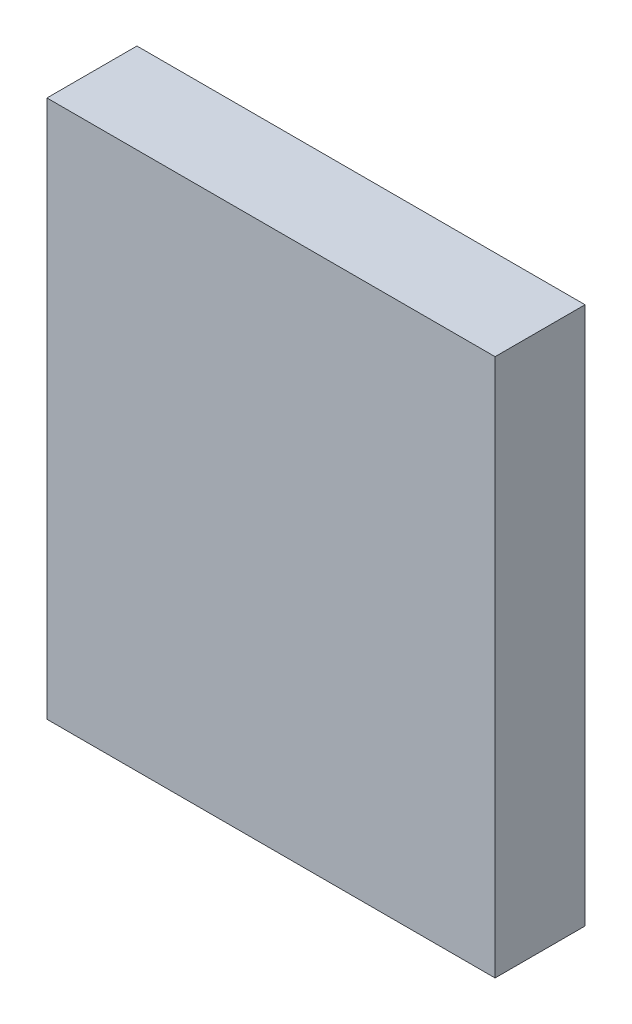
ISO-10303-21;
HEADER;
FILE_DESCRIPTION(('STEP AP214'),'2;1');
FILE_NAME('part.step','',(''),(''),'','','');
FILE_SCHEMA(('AUTOMOTIVE_DESIGN { 1 0 10303 214 1 1 1 1 }'));
ENDSEC;
DATA;
#1=APPLICATION_CONTEXT('core data for automotive mechanical design processes');
#2=APPLICATION_PROTOCOL_DEFINITION('international standard','automotive_design',2000,#1);
#3=PRODUCT_CONTEXT('',#1,'mechanical');
#4=PRODUCT('Part','Part','',(#3));
#5=PRODUCT_RELATED_PRODUCT_CATEGORY('part','',(#4));
#6=PRODUCT_DEFINITION_FORMATION('','',#4);
#7=PRODUCT_DEFINITION_CONTEXT('part definition',#1,'design');
#8=PRODUCT_DEFINITION('design','',#6,#7);
#9=PRODUCT_DEFINITION_SHAPE('','',#8);
#10=(LENGTH_UNIT() NAMED_UNIT(*) SI_UNIT(.MILLI.,.METRE.));
#11=(NAMED_UNIT(*) PLANE_ANGLE_UNIT() SI_UNIT($,.RADIAN.));
#12=(NAMED_UNIT(*) SI_UNIT($,.STERADIAN.) SOLID_ANGLE_UNIT());
#13=UNCERTAINTY_MEASURE_WITH_UNIT(LENGTH_MEASURE(1.E-05),#10,'distance_accuracy_value','');
#14=(GEOMETRIC_REPRESENTATION_CONTEXT(3) GLOBAL_UNCERTAINTY_ASSIGNED_CONTEXT((#13)) GLOBAL_UNIT_ASSIGNED_CONTEXT((#10,
#11,#12)) REPRESENTATION_CONTEXT('',''));
#15=CARTESIAN_POINT('',(0.,0.,0.));
#16=DIRECTION('',(0.,0.,1.));
#17=DIRECTION('',(1.,0.,0.));
#18=AXIS2_PLACEMENT_3D('',#15,#16,#17);
#19=CARTESIAN_POINT('',(-0.127,0.698,0.));
#20=DIRECTION('',(0.,-1.,0.));
#21=DIRECTION('',(0.,0.,1.));
#22=AXIS2_PLACEMENT_3D('',#19,#20,#21);
#23=PLANE('',#22);
#24=DIRECTION('',(-1.,0.,0.));
#25=VECTOR('',#24,1.);
#26=CARTESIAN_POINT('',(0.127,0.698,0.));
#27=LINE('',#26,#25);
#28=CARTESIAN_POINT('',(0.127,0.698,0.));
#29=VERTEX_POINT('',#28);
#30=CARTESIAN_POINT('',(-0.127,0.698,0.));
#31=VERTEX_POINT('',#30);
#32=EDGE_CURVE('E11',#29,#31,#27,.T.);
#33=ORIENTED_EDGE('',*,*,#32,.F.);
#34=DIRECTION('',(0.,0.,-1.));
#35=VECTOR('',#34,1.);
#36=CARTESIAN_POINT('',(0.127,0.698,0.051));
#37=LINE('',#36,#35);
#38=CARTESIAN_POINT('',(0.127,0.698,0.051));
#39=VERTEX_POINT('',#38);
#40=EDGE_CURVE('E24',#39,#29,#37,.T.);
#41=ORIENTED_EDGE('',*,*,#40,.F.);
#42=DIRECTION('',(1.,0.,0.));
#43=VECTOR('',#42,1.);
#44=CARTESIAN_POINT('',(-0.127,0.698,0.051));
#45=LINE('',#44,#43);
#46=CARTESIAN_POINT('',(-0.127,0.698,0.051));
#47=VERTEX_POINT('',#46);
#48=EDGE_CURVE('E88',#47,#39,#45,.T.);
#49=ORIENTED_EDGE('',*,*,#48,.F.);
#50=DIRECTION('',(0.,0.,1.));
#51=VECTOR('',#50,1.);
#52=CARTESIAN_POINT('',(-0.127,0.698,0.));
#53=LINE('',#52,#51);
#54=EDGE_CURVE('E77',#31,#47,#53,.T.);
#55=ORIENTED_EDGE('',*,*,#54,.F.);
#56=EDGE_LOOP('',(#33,#41,#49,#55));
#57=FACE_BOUND('',#56,.T.);
#58=ADVANCED_FACE('F17',(#57),#23,.T.);
#59=CARTESIAN_POINT('',(0.127,0.698,0.));
#60=DIRECTION('',(1.,0.,0.));
#61=DIRECTION('',(0.,0.,1.));
#62=AXIS2_PLACEMENT_3D('',#59,#60,#61);
#63=PLANE('',#62);
#64=DIRECTION('',(0.,-1.,0.));
#65=VECTOR('',#64,1.);
#66=CARTESIAN_POINT('',(0.127,1.003,0.));
#67=LINE('',#66,#65);
#68=CARTESIAN_POINT('',(0.127,1.003,0.));
#69=VERTEX_POINT('',#68);
#70=EDGE_CURVE('E85',#69,#29,#67,.T.);
#71=ORIENTED_EDGE('',*,*,#70,.F.);
#72=DIRECTION('',(0.,0.,-1.));
#73=VECTOR('',#72,1.);
#74=CARTESIAN_POINT('',(0.127,1.003,0.051));
#75=LINE('',#74,#73);
#76=CARTESIAN_POINT('',(0.127,1.003,0.051));
#77=VERTEX_POINT('',#76);
#78=EDGE_CURVE('E83',#77,#69,#75,.T.);
#79=ORIENTED_EDGE('',*,*,#78,.F.);
#80=DIRECTION('',(0.,1.,0.));
#81=VECTOR('',#80,1.);
#82=CARTESIAN_POINT('',(0.127,0.698,0.051));
#83=LINE('',#82,#81);
#84=EDGE_CURVE('E72',#39,#77,#83,.T.);
#85=ORIENTED_EDGE('',*,*,#84,.F.);
#86=ORIENTED_EDGE('',*,*,#40,.T.);
#87=EDGE_LOOP('',(#71,#79,#85,#86));
#88=FACE_BOUND('',#87,.T.);
#89=ADVANCED_FACE('F90',(#88),#63,.T.);
#90=CARTESIAN_POINT('',(0.127,1.003,0.));
#91=DIRECTION('',(0.,1.,0.));
#92=DIRECTION('',(0.,0.,1.));
#93=AXIS2_PLACEMENT_3D('',#90,#91,#92);
#94=PLANE('',#93);
#95=DIRECTION('',(1.,0.,0.));
#96=VECTOR('',#95,1.);
#97=CARTESIAN_POINT('',(-0.127,1.003,0.));
#98=LINE('',#97,#96);
#99=CARTESIAN_POINT('',(-0.127,1.003,0.));
#100=VERTEX_POINT('',#99);
#101=EDGE_CURVE('E60',#100,#69,#98,.T.);
#102=ORIENTED_EDGE('',*,*,#101,.F.);
#103=DIRECTION('',(0.,0.,-1.));
#104=VECTOR('',#103,1.);
#105=CARTESIAN_POINT('',(-0.127,1.003,0.051));
#106=LINE('',#105,#104);
#107=CARTESIAN_POINT('',(-0.127,1.003,0.051));
#108=VERTEX_POINT('',#107);
#109=EDGE_CURVE('E54',#108,#100,#106,.T.);
#110=ORIENTED_EDGE('',*,*,#109,.F.);
#111=DIRECTION('',(-1.,0.,0.));
#112=VECTOR('',#111,1.);
#113=CARTESIAN_POINT('',(0.127,1.003,0.051));
#114=LINE('',#113,#112);
#115=EDGE_CURVE('E58',#77,#108,#114,.T.);
#116=ORIENTED_EDGE('',*,*,#115,.F.);
#117=ORIENTED_EDGE('',*,*,#78,.T.);
#118=EDGE_LOOP('',(#102,#110,#116,#117));
#119=FACE_BOUND('',#118,.T.);
#120=ADVANCED_FACE('F56',(#119),#94,.T.);
#121=CARTESIAN_POINT('',(-0.127,1.003,0.));
#122=DIRECTION('',(-1.,0.,0.));
#123=DIRECTION('',(0.,0.,1.));
#124=AXIS2_PLACEMENT_3D('',#121,#122,#123);
#125=PLANE('',#124);
#126=DIRECTION('',(0.,1.,0.));
#127=VECTOR('',#126,1.);
#128=CARTESIAN_POINT('',(-0.127,0.698,0.));
#129=LINE('',#128,#127);
#130=EDGE_CURVE('E73',#31,#100,#129,.T.);
#131=ORIENTED_EDGE('',*,*,#130,.F.);
#132=ORIENTED_EDGE('',*,*,#54,.T.);
#133=DIRECTION('',(0.,-1.,0.));
#134=VECTOR('',#133,1.);
#135=CARTESIAN_POINT('',(-0.127,1.003,0.051));
#136=LINE('',#135,#134);
#137=EDGE_CURVE('E70',#108,#47,#136,.T.);
#138=ORIENTED_EDGE('',*,*,#137,.F.);
#139=ORIENTED_EDGE('',*,*,#109,.T.);
#140=EDGE_LOOP('',(#131,#132,#138,#139));
#141=FACE_BOUND('',#140,.T.);
#142=ADVANCED_FACE('F76',(#141),#125,.T.);
#143=CARTESIAN_POINT('',(-0.127,1.003,0.));
#144=DIRECTION('',(0.,0.,-1.));
#145=DIRECTION('',(0.,1.,0.));
#146=AXIS2_PLACEMENT_3D('',#143,#144,#145);
#147=PLANE('',#146);
#148=ORIENTED_EDGE('',*,*,#101,.T.);
#149=ORIENTED_EDGE('',*,*,#70,.T.);
#150=ORIENTED_EDGE('',*,*,#32,.T.);
#151=ORIENTED_EDGE('',*,*,#130,.T.);
#152=EDGE_LOOP('',(#148,#149,#150,#151));
#153=FACE_BOUND('',#152,.T.);
#154=ADVANCED_FACE('F91',(#153),#147,.T.);
#155=CARTESIAN_POINT('',(-0.127,0.698,0.051));
#156=DIRECTION('',(0.,0.,1.));
#157=DIRECTION('',(0.,1.,0.));
#158=AXIS2_PLACEMENT_3D('',#155,#156,#157);
#159=PLANE('',#158);
#160=ORIENTED_EDGE('',*,*,#48,.T.);
#161=ORIENTED_EDGE('',*,*,#84,.T.);
#162=ORIENTED_EDGE('',*,*,#115,.T.);
#163=ORIENTED_EDGE('',*,*,#137,.T.);
#164=EDGE_LOOP('',(#160,#161,#162,#163));
#165=FACE_BOUND('',#164,.T.);
#166=ADVANCED_FACE('F69',(#165),#159,.T.);
#167=CLOSED_SHELL('',(#58,#89,#120,#142,#154,#166));
#168=MANIFOLD_SOLID_BREP('B1',#167);
#169=ADVANCED_BREP_SHAPE_REPRESENTATION('',(#18,#168),#14);
#170=SHAPE_DEFINITION_REPRESENTATION(#9,#169);
ENDSEC;
END-ISO-10303-21;
